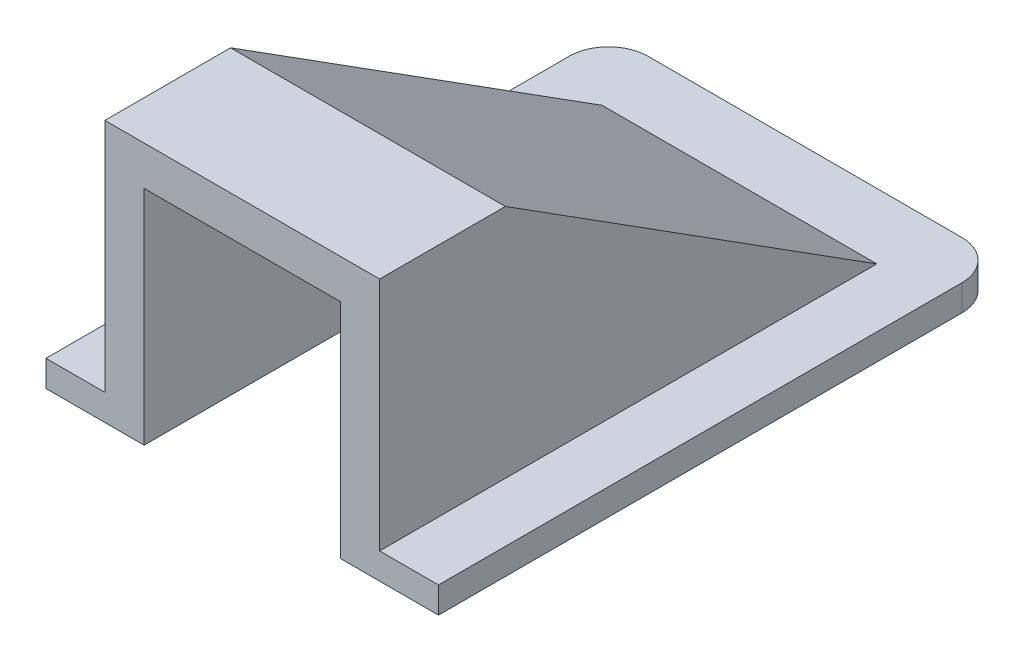
ISO-10303-21;
HEADER;
FILE_DESCRIPTION(('STEP AP214'),'2;1');
FILE_NAME('part.step','',(''),(''),'','','');
FILE_SCHEMA(('AUTOMOTIVE_DESIGN { 1 0 10303 214 1 1 1 1 }'));
ENDSEC;
DATA;
#1=APPLICATION_CONTEXT('core data for automotive mechanical design processes');
#2=APPLICATION_PROTOCOL_DEFINITION('international standard','automotive_design',2000,#1);
#3=PRODUCT_CONTEXT('',#1,'mechanical');
#4=PRODUCT('Part','Part','',(#3));
#5=PRODUCT_RELATED_PRODUCT_CATEGORY('part','',(#4));
#6=PRODUCT_DEFINITION_FORMATION('','',#4);
#7=PRODUCT_DEFINITION_CONTEXT('part definition',#1,'design');
#8=PRODUCT_DEFINITION('design','',#6,#7);
#9=PRODUCT_DEFINITION_SHAPE('','',#8);
#10=(LENGTH_UNIT() NAMED_UNIT(*) SI_UNIT(.MILLI.,.METRE.));
#11=(NAMED_UNIT(*) PLANE_ANGLE_UNIT() SI_UNIT($,.RADIAN.));
#12=(NAMED_UNIT(*) SI_UNIT($,.STERADIAN.) SOLID_ANGLE_UNIT());
#13=UNCERTAINTY_MEASURE_WITH_UNIT(LENGTH_MEASURE(1.E-05),#10,'distance_accuracy_value','');
#14=(GEOMETRIC_REPRESENTATION_CONTEXT(3) GLOBAL_UNCERTAINTY_ASSIGNED_CONTEXT((#13)) GLOBAL_UNIT_ASSIGNED_CONTEXT((#10,
#11,#12)) REPRESENTATION_CONTEXT('',''));
#15=CARTESIAN_POINT('',(0.,0.,0.));
#16=DIRECTION('',(0.,0.,1.));
#17=DIRECTION('',(1.,0.,0.));
#18=AXIS2_PLACEMENT_3D('',#15,#16,#17);
#19=CARTESIAN_POINT('',(30.,1.47718631178707,41.2832699619772));
#20=DIRECTION('',(0.,0.,-1.));
#21=DIRECTION('',(0.,1.,0.));
#22=AXIS2_PLACEMENT_3D('',#19,#20,#21);
#23=PLANE('',#22);
#24=DIRECTION('',(-1.,0.,0.));
#25=VECTOR('',#24,1.);
#26=CARTESIAN_POINT('',(30.,-18.5228136882129,41.2832699619772));
#27=LINE('',#26,#25);
#28=CARTESIAN_POINT('',(30.,-18.5228136882129,41.2832699619772));
#29=VERTEX_POINT('',#28);
#30=CARTESIAN_POINT('',(22.5,-18.5228136882129,41.2832699619772));
#31=VERTEX_POINT('',#30);
#32=EDGE_CURVE('E170',#29,#31,#27,.T.);
#33=ORIENTED_EDGE('',*,*,#32,.F.);
#34=DIRECTION('',(0.,-1.,0.));
#35=VECTOR('',#34,1.);
#36=CARTESIAN_POINT('',(30.,1.47718631178707,41.2832699619772));
#37=LINE('',#36,#35);
#38=CARTESIAN_POINT('',(30.,-16.5228136882129,41.2832699619772));
#39=VERTEX_POINT('',#38);
#40=EDGE_CURVE('E230',#39,#29,#37,.T.);
#41=ORIENTED_EDGE('',*,*,#40,.F.);
#42=DIRECTION('',(1.,0.,0.));
#43=VECTOR('',#42,1.);
#44=CARTESIAN_POINT('',(25.5,-16.5228136882129,41.2832699619772));
#45=LINE('',#44,#43);
#46=CARTESIAN_POINT('',(25.5,-16.5228136882129,41.2832699619772));
#47=VERTEX_POINT('',#46);
#48=EDGE_CURVE('E193',#47,#39,#45,.T.);
#49=ORIENTED_EDGE('',*,*,#48,.F.);
#50=DIRECTION('',(0.,-1.,0.));
#51=VECTOR('',#50,1.);
#52=CARTESIAN_POINT('',(25.5,1.47718631178707,41.2832699619772));
#53=LINE('',#52,#51);
#54=CARTESIAN_POINT('',(25.5,1.47718631178707,41.2832699619772));
#55=VERTEX_POINT('',#54);
#56=EDGE_CURVE('E392',#55,#47,#53,.T.);
#57=ORIENTED_EDGE('',*,*,#56,.F.);
#58=DIRECTION('',(-1.,0.,0.));
#59=VECTOR('',#58,1.);
#60=CARTESIAN_POINT('',(30.,1.47718631178707,41.2832699619772));
#61=LINE('',#60,#59);
#62=CARTESIAN_POINT('',(4.5,1.47718631178707,41.2832699619772));
#63=VERTEX_POINT('',#62);
#64=EDGE_CURVE('E234',#55,#63,#61,.T.);
#65=ORIENTED_EDGE('',*,*,#64,.T.);
#66=DIRECTION('',(0.,1.,0.));
#67=VECTOR('',#66,1.);
#68=CARTESIAN_POINT('',(4.5,-16.5228136882129,41.2832699619772));
#69=LINE('',#68,#67);
#70=CARTESIAN_POINT('',(4.5,-16.5228136882129,41.2832699619772));
#71=VERTEX_POINT('',#70);
#72=EDGE_CURVE('E382',#71,#63,#69,.T.);
#73=ORIENTED_EDGE('',*,*,#72,.F.);
#74=DIRECTION('',(-1.,0.,0.));
#75=VECTOR('',#74,1.);
#76=CARTESIAN_POINT('',(4.5,-16.5228136882129,41.2832699619772));
#77=LINE('',#76,#75);
#78=CARTESIAN_POINT('',(0.,-16.5228136882129,41.2832699619772));
#79=VERTEX_POINT('',#78);
#80=EDGE_CURVE('E389',#71,#79,#77,.T.);
#81=ORIENTED_EDGE('',*,*,#80,.T.);
#82=DIRECTION('',(0.,-1.,0.));
#83=VECTOR('',#82,1.);
#84=CARTESIAN_POINT('',(0.,1.47718631178707,41.2832699619772));
#85=LINE('',#84,#83);
#86=CARTESIAN_POINT('',(0.,-18.5228136882129,41.2832699619772));
#87=VERTEX_POINT('',#86);
#88=EDGE_CURVE('E168',#79,#87,#85,.T.);
#89=ORIENTED_EDGE('',*,*,#88,.T.);
#90=CARTESIAN_POINT('',(7.5,-18.5228136882129,41.2832699619772));
#91=VERTEX_POINT('',#90);
#92=EDGE_CURVE('E150',#91,#87,#27,.T.);
#93=ORIENTED_EDGE('',*,*,#92,.F.);
#94=DIRECTION('',(0.,1.,0.));
#95=VECTOR('',#94,1.);
#96=CARTESIAN_POINT('',(7.5,-16.5228136882129,41.2832699619772));
#97=LINE('',#96,#95);
#98=CARTESIAN_POINT('',(7.5,-1.52281368821293,41.2832699619772));
#99=VERTEX_POINT('',#98);
#100=EDGE_CURVE('E164',#91,#99,#97,.T.);
#101=ORIENTED_EDGE('',*,*,#100,.T.);
#102=DIRECTION('',(1.,0.,0.));
#103=VECTOR('',#102,1.);
#104=CARTESIAN_POINT('',(-35.7012285450742,-1.52281368821293,41.2832699619772));
#105=LINE('',#104,#103);
#106=CARTESIAN_POINT('',(22.5,-1.52281368821293,41.2832699619772));
#107=VERTEX_POINT('',#106);
#108=EDGE_CURVE('E202',#99,#107,#105,.T.);
#109=ORIENTED_EDGE('',*,*,#108,.T.);
#110=DIRECTION('',(0.,-1.,0.));
#111=VECTOR('',#110,1.);
#112=CARTESIAN_POINT('',(22.5,-16.5228136882129,41.2832699619772));
#113=LINE('',#112,#111);
#114=EDGE_CURVE('E188',#107,#31,#113,.T.);
#115=ORIENTED_EDGE('',*,*,#114,.T.);
#116=EDGE_LOOP('',(#33,#41,#49,#57,#65,#73,#81,#89,#93,#101,#109,#115));
#117=FACE_BOUND('',#116,.T.);
#118=ADVANCED_FACE('F40',(#117),#23,.F.);
#119=CARTESIAN_POINT('',(30.,0.,0.));
#120=DIRECTION('',(1.,0.,0.));
#121=DIRECTION('',(0.,0.,-1.));
#122=AXIS2_PLACEMENT_3D('',#119,#120,#121);
#123=PLANE('',#122);
#124=ORIENTED_EDGE('',*,*,#40,.T.);
#125=DIRECTION('',(0.,0.,1.));
#126=VECTOR('',#125,1.);
#127=CARTESIAN_POINT('',(30.,-18.5228136882129,38.2832699619772));
#128=LINE('',#127,#126);
#129=CARTESIAN_POINT('',(30.,-18.5228136882129,1.28326996197718));
#130=VERTEX_POINT('',#129);
#131=EDGE_CURVE('E211',#130,#29,#128,.T.);
#132=ORIENTED_EDGE('',*,*,#131,.F.);
#133=DIRECTION('',(0.,1.,0.));
#134=VECTOR('',#133,1.);
#135=CARTESIAN_POINT('',(30.,-16.5228136882129,1.28326996197718));
#136=LINE('',#135,#134);
#137=CARTESIAN_POINT('',(30.,-16.5228136882129,1.28326996197718));
#138=VERTEX_POINT('',#137);
#139=EDGE_CURVE('E243',#130,#138,#136,.T.);
#140=ORIENTED_EDGE('',*,*,#139,.T.);
#141=DIRECTION('',(0.,0.,-1.));
#142=VECTOR('',#141,1.);
#143=CARTESIAN_POINT('',(30.,-16.5228136882129,3.28326996197718));
#144=LINE('',#143,#142);
#145=EDGE_CURVE('E177',#39,#138,#144,.T.);
#146=ORIENTED_EDGE('',*,*,#145,.F.);
#147=EDGE_LOOP('',(#124,#132,#140,#146));
#148=FACE_BOUND('',#147,.T.);
#149=ADVANCED_FACE('F270',(#148),#123,.T.);
#150=CARTESIAN_POINT('',(0.,0.,0.));
#151=DIRECTION('',(1.,0.,0.));
#152=DIRECTION('',(0.,0.,-1.));
#153=AXIS2_PLACEMENT_3D('',#150,#151,#152);
#154=PLANE('',#153);
#155=DIRECTION('',(0.,0.,1.));
#156=VECTOR('',#155,1.);
#157=CARTESIAN_POINT('',(0.,-18.5228136882129,0.));
#158=LINE('',#157,#156);
#159=CARTESIAN_POINT('',(0.,-18.5228136882129,1.28326996197718));
#160=VERTEX_POINT('',#159);
#161=EDGE_CURVE('E240',#160,#87,#158,.T.);
#162=ORIENTED_EDGE('',*,*,#161,.T.);
#163=ORIENTED_EDGE('',*,*,#88,.F.);
#164=DIRECTION('',(0.,0.,-1.));
#165=VECTOR('',#164,1.);
#166=CARTESIAN_POINT('',(0.,-16.5228136882129,3.28326996197718));
#167=LINE('',#166,#165);
#168=CARTESIAN_POINT('',(0.,-16.5228136882129,1.28326996197718));
#169=VERTEX_POINT('',#168);
#170=EDGE_CURVE('E182',#79,#169,#167,.T.);
#171=ORIENTED_EDGE('',*,*,#170,.T.);
#172=DIRECTION('',(0.,1.,0.));
#173=VECTOR('',#172,1.);
#174=CARTESIAN_POINT('',(0.,0.,1.28326996197719));
#175=LINE('',#174,#173);
#176=EDGE_CURVE('E12',#169,#160,#175,.F.);
#177=ORIENTED_EDGE('',*,*,#176,.T.);
#178=EDGE_LOOP('',(#162,#163,#171,#177));
#179=FACE_BOUND('',#178,.T.);
#180=ADVANCED_FACE('F282',(#179),#154,.F.);
#181=CARTESIAN_POINT('',(22.5,0.,0.));
#182=DIRECTION('',(-1.,0.,0.));
#183=DIRECTION('',(0.,0.,1.));
#184=AXIS2_PLACEMENT_3D('',#181,#182,#183);
#185=PLANE('',#184);
#186=DIRECTION('',(0.,0.,-1.));
#187=VECTOR('',#186,1.);
#188=CARTESIAN_POINT('',(22.5,-18.5228136882129,38.2832699619772));
#189=LINE('',#188,#187);
#190=CARTESIAN_POINT('',(22.5,-18.5228136882129,8.8860830528083));
#191=VERTEX_POINT('',#190);
#192=EDGE_CURVE('E56',#31,#191,#189,.T.);
#193=ORIENTED_EDGE('',*,*,#192,.F.);
#194=ORIENTED_EDGE('',*,*,#114,.F.);
#195=DIRECTION('',(0.,0.,1.));
#196=VECTOR('',#195,1.);
#197=CARTESIAN_POINT('',(22.5,-1.52281368821293,41.2832699619772));
#198=LINE('',#197,#196);
#199=CARTESIAN_POINT('',(22.5,-1.52281368821293,32.5459195541393));
#200=VERTEX_POINT('',#199);
#201=EDGE_CURVE('E197',#200,#107,#198,.T.);
#202=ORIENTED_EDGE('',*,*,#201,.F.);
#203=DIRECTION('',(0.,0.535445311375715,0.844569901503578));
#204=VECTOR('',#203,1.);
#205=CARTESIAN_POINT('',(22.5,-1.52281368821293,32.5459195541393));
#206=LINE('',#205,#204);
#207=CARTESIAN_POINT('',(22.5,-16.5228136882129,8.8860830528083));
#208=VERTEX_POINT('',#207);
#209=EDGE_CURVE('E192',#208,#200,#206,.T.);
#210=ORIENTED_EDGE('',*,*,#209,.F.);
#211=DIRECTION('',(0.,1.,0.));
#212=VECTOR('',#211,1.);
#213=CARTESIAN_POINT('',(22.5,-21.0228136882129,8.8860830528083));
#214=LINE('',#213,#212);
#215=EDGE_CURVE('E159',#191,#208,#214,.T.);
#216=ORIENTED_EDGE('',*,*,#215,.F.);
#217=EDGE_LOOP('',(#193,#194,#202,#210,#216));
#218=FACE_BOUND('',#217,.T.);
#219=ADVANCED_FACE('F284',(#218),#185,.T.);
#220=CARTESIAN_POINT('',(7.5,0.,0.));
#221=DIRECTION('',(1.,0.,0.));
#222=DIRECTION('',(0.,0.,-1.));
#223=AXIS2_PLACEMENT_3D('',#220,#221,#222);
#224=PLANE('',#223);
#225=ORIENTED_EDGE('',*,*,#100,.F.);
#226=DIRECTION('',(0.,0.,1.));
#227=VECTOR('',#226,1.);
#228=CARTESIAN_POINT('',(7.5,-18.5228136882129,38.2832699619772));
#229=LINE('',#228,#227);
#230=CARTESIAN_POINT('',(7.5,-18.5228136882129,8.8860830528083));
#231=VERTEX_POINT('',#230);
#232=EDGE_CURVE('E147',#231,#91,#229,.T.);
#233=ORIENTED_EDGE('',*,*,#232,.F.);
#234=DIRECTION('',(0.,1.,0.));
#235=VECTOR('',#234,1.);
#236=CARTESIAN_POINT('',(7.5,-21.0228136882129,8.8860830528083));
#237=LINE('',#236,#235);
#238=CARTESIAN_POINT('',(7.5,-16.5228136882129,8.8860830528083));
#239=VERTEX_POINT('',#238);
#240=EDGE_CURVE('E370',#231,#239,#237,.T.);
#241=ORIENTED_EDGE('',*,*,#240,.T.);
#242=DIRECTION('',(0.,-0.535445311375715,-0.844569901503578));
#243=VECTOR('',#242,1.);
#244=CARTESIAN_POINT('',(7.5,-1.52281368821293,32.5459195541393));
#245=LINE('',#244,#243);
#246=CARTESIAN_POINT('',(7.5,-1.52281368821293,32.5459195541393));
#247=VERTEX_POINT('',#246);
#248=EDGE_CURVE('E184',#247,#239,#245,.T.);
#249=ORIENTED_EDGE('',*,*,#248,.F.);
#250=DIRECTION('',(0.,0.,-1.));
#251=VECTOR('',#250,1.);
#252=CARTESIAN_POINT('',(7.5,-1.52281368821293,41.2832699619772));
#253=LINE('',#252,#251);
#254=EDGE_CURVE('E175',#99,#247,#253,.T.);
#255=ORIENTED_EDGE('',*,*,#254,.F.);
#256=EDGE_LOOP('',(#225,#233,#241,#249,#255));
#257=FACE_BOUND('',#256,.T.);
#258=ADVANCED_FACE('F173',(#257),#224,.T.);
#259=CARTESIAN_POINT('',(30.,1.47718631178707,41.2832699619772));
#260=DIRECTION('',(0.,-1.,0.));
#261=DIRECTION('',(0.,0.,-1.));
#262=AXIS2_PLACEMENT_3D('',#259,#260,#261);
#263=PLANE('',#262);
#264=DIRECTION('',(0.,0.,-1.));
#265=VECTOR('',#264,1.);
#266=CARTESIAN_POINT('',(4.5,1.47718631178707,41.2832699619772));
#267=LINE('',#266,#265);
#268=CARTESIAN_POINT('',(4.5,1.47718631178707,31.6750737635743));
#269=VERTEX_POINT('',#268);
#270=EDGE_CURVE('E349',#63,#269,#267,.T.);
#271=ORIENTED_EDGE('',*,*,#270,.F.);
#272=ORIENTED_EDGE('',*,*,#64,.F.);
#273=DIRECTION('',(0.,0.,1.));
#274=VECTOR('',#273,1.);
#275=CARTESIAN_POINT('',(25.5,1.47718631178707,31.6750737635743));
#276=LINE('',#275,#274);
#277=CARTESIAN_POINT('',(25.5,1.47718631178707,31.6750737635743));
#278=VERTEX_POINT('',#277);
#279=EDGE_CURVE('E354',#278,#55,#276,.T.);
#280=ORIENTED_EDGE('',*,*,#279,.F.);
#281=DIRECTION('',(1.,0.,0.));
#282=VECTOR('',#281,1.);
#283=CARTESIAN_POINT('',(0.,1.47718631178707,31.6750737635743));
#284=LINE('',#283,#282);
#285=EDGE_CURVE('E217',#269,#278,#284,.T.);
#286=ORIENTED_EDGE('',*,*,#285,.F.);
#287=EDGE_LOOP('',(#271,#272,#280,#286));
#288=FACE_BOUND('',#287,.T.);
#289=ADVANCED_FACE('F319',(#288),#263,.F.);
#290=CARTESIAN_POINT('',(0.,1.47718631178707,31.6750737635743));
#291=DIRECTION('',(0.,-0.844569901503578,0.535445311375715));
#292=DIRECTION('',(0.,-0.535445311375715,-0.844569901503578));
#293=AXIS2_PLACEMENT_3D('',#290,#291,#292);
#294=PLANE('',#293);
#295=DIRECTION('',(0.,-0.535445311375715,-0.844569901503578));
#296=VECTOR('',#295,1.);
#297=CARTESIAN_POINT('',(4.5,1.47718631178707,31.6750737635743));
#298=LINE('',#297,#296);
#299=CARTESIAN_POINT('',(4.5,-16.5228136882129,3.28326996197718));
#300=VERTEX_POINT('',#299);
#301=EDGE_CURVE('E341',#269,#300,#298,.T.);
#302=ORIENTED_EDGE('',*,*,#301,.F.);
#303=ORIENTED_EDGE('',*,*,#285,.T.);
#304=DIRECTION('',(0.,0.535445311375715,0.844569901503578));
#305=VECTOR('',#304,1.);
#306=CARTESIAN_POINT('',(25.5,-16.5228136882129,3.28326996197718));
#307=LINE('',#306,#305);
#308=CARTESIAN_POINT('',(25.5,-16.5228136882129,3.28326996197718));
#309=VERTEX_POINT('',#308);
#310=EDGE_CURVE('E358',#309,#278,#307,.T.);
#311=ORIENTED_EDGE('',*,*,#310,.F.);
#312=DIRECTION('',(1.,0.,0.));
#313=VECTOR('',#312,1.);
#314=CARTESIAN_POINT('',(0.,-16.5228136882129,3.28326996197718));
#315=LINE('',#314,#313);
#316=EDGE_CURVE('E222',#300,#309,#315,.T.);
#317=ORIENTED_EDGE('',*,*,#316,.F.);
#318=EDGE_LOOP('',(#302,#303,#311,#317));
#319=FACE_BOUND('',#318,.T.);
#320=ADVANCED_FACE('F331',(#319),#294,.F.);
#321=CARTESIAN_POINT('',(30.,1.47718631178707,-1.71673003802281));
#322=DIRECTION('',(0.,0.,1.));
#323=DIRECTION('',(0.,-1.,0.));
#324=AXIS2_PLACEMENT_3D('',#321,#322,#323);
#325=PLANE('',#324);
#326=DIRECTION('',(1.,0.,0.));
#327=VECTOR('',#326,1.);
#328=CARTESIAN_POINT('',(0.,-16.5228136882129,-1.71673003802282));
#329=LINE('',#328,#327);
#330=CARTESIAN_POINT('',(3.,-16.5228136882129,-1.71673003802282));
#331=VERTEX_POINT('',#330);
#332=CARTESIAN_POINT('',(27.,-16.5228136882129,-1.71673003802282));
#333=VERTEX_POINT('',#332);
#334=EDGE_CURVE('E215',#331,#333,#329,.T.);
#335=ORIENTED_EDGE('',*,*,#334,.T.);
#336=DIRECTION('',(0.,1.,0.));
#337=VECTOR('',#336,1.);
#338=CARTESIAN_POINT('',(27.,-18.5228136882129,-1.71673003802282));
#339=LINE('',#338,#337);
#340=CARTESIAN_POINT('',(27.,-18.5228136882129,-1.71673003802282));
#341=VERTEX_POINT('',#340);
#342=EDGE_CURVE('E257',#333,#341,#339,.F.);
#343=ORIENTED_EDGE('',*,*,#342,.T.);
#344=DIRECTION('',(-1.,0.,0.));
#345=VECTOR('',#344,1.);
#346=CARTESIAN_POINT('',(30.,-18.5228136882129,-1.71673003802282));
#347=LINE('',#346,#345);
#348=CARTESIAN_POINT('',(3.,-18.5228136882129,-1.71673003802282));
#349=VERTEX_POINT('',#348);
#350=EDGE_CURVE('E214',#341,#349,#347,.T.);
#351=ORIENTED_EDGE('',*,*,#350,.T.);
#352=DIRECTION('',(0.,1.,0.));
#353=VECTOR('',#352,1.);
#354=CARTESIAN_POINT('',(3.,1.47718631178707,-1.71673003802281));
#355=LINE('',#354,#353);
#356=EDGE_CURVE('E253',#349,#331,#355,.T.);
#357=ORIENTED_EDGE('',*,*,#356,.T.);
#358=EDGE_LOOP('',(#335,#343,#351,#357));
#359=FACE_BOUND('',#358,.T.);
#360=ADVANCED_FACE('F278',(#359),#325,.F.);
#361=CARTESIAN_POINT('',(0.,-16.5228136882129,3.28326996197718));
#362=DIRECTION('',(0.,-1.,0.));
#363=DIRECTION('',(0.,0.,-1.));
#364=AXIS2_PLACEMENT_3D('',#361,#362,#363);
#365=PLANE('',#364);
#366=ORIENTED_EDGE('',*,*,#145,.T.);
#367=CARTESIAN_POINT('',(27.,-16.5228136882129,1.28326996197718));
#368=DIRECTION('',(0.,-1.,0.));
#369=DIRECTION('',(0.,0.,-1.));
#370=AXIS2_PLACEMENT_3D('',#367,#368,#369);
#371=CIRCLE('',#370,3.);
#372=EDGE_CURVE('E250',#138,#333,#371,.F.);
#373=ORIENTED_EDGE('',*,*,#372,.T.);
#374=ORIENTED_EDGE('',*,*,#334,.F.);
#375=CARTESIAN_POINT('',(3.,-16.5228136882129,1.28326996197718));
#376=DIRECTION('',(0.,-1.,0.));
#377=DIRECTION('',(0.,0.,-1.));
#378=AXIS2_PLACEMENT_3D('',#375,#376,#377);
#379=CIRCLE('',#378,3.);
#380=EDGE_CURVE('E247',#331,#169,#379,.F.);
#381=ORIENTED_EDGE('',*,*,#380,.T.);
#382=ORIENTED_EDGE('',*,*,#170,.F.);
#383=ORIENTED_EDGE('',*,*,#80,.F.);
#384=DIRECTION('',(0.,0.,1.));
#385=VECTOR('',#384,1.);
#386=CARTESIAN_POINT('',(4.5,-16.5228136882129,3.28326996197718));
#387=LINE('',#386,#385);
#388=EDGE_CURVE('E348',#300,#71,#387,.T.);
#389=ORIENTED_EDGE('',*,*,#388,.F.);
#390=ORIENTED_EDGE('',*,*,#316,.T.);
#391=DIRECTION('',(0.,0.,-1.));
#392=VECTOR('',#391,1.);
#393=CARTESIAN_POINT('',(25.5,-16.5228136882129,3.28326996197718));
#394=LINE('',#393,#392);
#395=EDGE_CURVE('E363',#47,#309,#394,.T.);
#396=ORIENTED_EDGE('',*,*,#395,.F.);
#397=ORIENTED_EDGE('',*,*,#48,.T.);
#398=EDGE_LOOP('',(#366,#373,#374,#381,#382,#383,#389,#390,#396,#397));
#399=FACE_BOUND('',#398,.T.);
#400=ADVANCED_FACE('F275',(#399),#365,.F.);
#401=CARTESIAN_POINT('',(0.,-18.5228136882129,38.2832699619772));
#402=DIRECTION('',(0.,1.,0.));
#403=DIRECTION('',(0.,0.,1.));
#404=AXIS2_PLACEMENT_3D('',#401,#402,#403);
#405=PLANE('',#404);
#406=ORIENTED_EDGE('',*,*,#192,.T.);
#407=DIRECTION('',(-1.,0.,0.));
#408=VECTOR('',#407,1.);
#409=CARTESIAN_POINT('',(0.,-18.5228136882129,8.8860830528083));
#410=LINE('',#409,#408);
#411=EDGE_CURVE('E153',#191,#231,#410,.T.);
#412=ORIENTED_EDGE('',*,*,#411,.T.);
#413=ORIENTED_EDGE('',*,*,#232,.T.);
#414=ORIENTED_EDGE('',*,*,#92,.T.);
#415=ORIENTED_EDGE('',*,*,#161,.F.);
#416=CARTESIAN_POINT('',(3.,-18.5228136882129,1.28326996197718));
#417=DIRECTION('',(0.,1.,0.));
#418=DIRECTION('',(0.,0.,1.));
#419=AXIS2_PLACEMENT_3D('',#416,#417,#418);
#420=CIRCLE('',#419,3.);
#421=EDGE_CURVE('E260',#160,#349,#420,.F.);
#422=ORIENTED_EDGE('',*,*,#421,.T.);
#423=ORIENTED_EDGE('',*,*,#350,.F.);
#424=CARTESIAN_POINT('',(27.,-18.5228136882129,1.28326996197718));
#425=DIRECTION('',(0.,1.,0.));
#426=DIRECTION('',(0.,0.,1.));
#427=AXIS2_PLACEMENT_3D('',#424,#425,#426);
#428=CIRCLE('',#427,3.);
#429=EDGE_CURVE('E49',#341,#130,#428,.F.);
#430=ORIENTED_EDGE('',*,*,#429,.T.);
#431=ORIENTED_EDGE('',*,*,#131,.T.);
#432=ORIENTED_EDGE('',*,*,#32,.T.);
#433=EDGE_LOOP('',(#406,#412,#413,#414,#415,#422,#423,#430,#431,#432));
#434=FACE_BOUND('',#433,.T.);
#435=ADVANCED_FACE('F149',(#434),#405,.F.);
#436=CARTESIAN_POINT('',(-35.7012285450742,-1.52281368821293,41.2832699619772));
#437=DIRECTION('',(0.,1.,0.));
#438=DIRECTION('',(0.,0.,1.));
#439=AXIS2_PLACEMENT_3D('',#436,#437,#438);
#440=PLANE('',#439);
#441=ORIENTED_EDGE('',*,*,#254,.T.);
#442=DIRECTION('',(1.,0.,0.));
#443=VECTOR('',#442,1.);
#444=CARTESIAN_POINT('',(-35.7012285450742,-1.52281368821293,32.5459195541393));
#445=LINE('',#444,#443);
#446=EDGE_CURVE('E205',#247,#200,#445,.T.);
#447=ORIENTED_EDGE('',*,*,#446,.T.);
#448=ORIENTED_EDGE('',*,*,#201,.T.);
#449=ORIENTED_EDGE('',*,*,#108,.F.);
#450=EDGE_LOOP('',(#441,#447,#448,#449));
#451=FACE_BOUND('',#450,.T.);
#452=ADVANCED_FACE('F321',(#451),#440,.F.);
#453=CARTESIAN_POINT('',(-35.7012285450742,-1.52281368821293,32.5459195541393));
#454=DIRECTION('',(0.,0.844569901503578,-0.535445311375715));
#455=DIRECTION('',(0.,0.535445311375715,0.844569901503578));
#456=AXIS2_PLACEMENT_3D('',#453,#454,#455);
#457=PLANE('',#456);
#458=ORIENTED_EDGE('',*,*,#248,.T.);
#459=DIRECTION('',(1.,0.,0.));
#460=VECTOR('',#459,1.);
#461=CARTESIAN_POINT('',(-35.7012285450742,-16.5228136882129,8.8860830528083));
#462=LINE('',#461,#460);
#463=EDGE_CURVE('E201',#239,#208,#462,.T.);
#464=ORIENTED_EDGE('',*,*,#463,.T.);
#465=ORIENTED_EDGE('',*,*,#209,.T.);
#466=ORIENTED_EDGE('',*,*,#446,.F.);
#467=EDGE_LOOP('',(#458,#464,#465,#466));
#468=FACE_BOUND('',#467,.T.);
#469=ADVANCED_FACE('F313',(#468),#457,.F.);
#470=CARTESIAN_POINT('',(25.5,0.,0.));
#471=DIRECTION('',(-1.,0.,0.));
#472=DIRECTION('',(0.,0.,1.));
#473=AXIS2_PLACEMENT_3D('',#470,#471,#472);
#474=PLANE('',#473);
#475=ORIENTED_EDGE('',*,*,#56,.T.);
#476=ORIENTED_EDGE('',*,*,#395,.T.);
#477=ORIENTED_EDGE('',*,*,#310,.T.);
#478=ORIENTED_EDGE('',*,*,#279,.T.);
#479=EDGE_LOOP('',(#475,#476,#477,#478));
#480=FACE_BOUND('',#479,.T.);
#481=ADVANCED_FACE('F306',(#480),#474,.F.);
#482=CARTESIAN_POINT('',(4.5,0.,0.));
#483=DIRECTION('',(-1.,0.,0.));
#484=DIRECTION('',(0.,0.,1.));
#485=AXIS2_PLACEMENT_3D('',#482,#483,#484);
#486=PLANE('',#485);
#487=ORIENTED_EDGE('',*,*,#72,.T.);
#488=ORIENTED_EDGE('',*,*,#270,.T.);
#489=ORIENTED_EDGE('',*,*,#301,.T.);
#490=ORIENTED_EDGE('',*,*,#388,.T.);
#491=EDGE_LOOP('',(#487,#488,#489,#490));
#492=FACE_BOUND('',#491,.T.);
#493=ADVANCED_FACE('F300',(#492),#486,.T.);
#494=CARTESIAN_POINT('',(27.,0.,1.28326996197719));
#495=DIRECTION('',(0.,-1.,0.));
#496=DIRECTION('',(0.,0.,-1.));
#497=AXIS2_PLACEMENT_3D('',#494,#495,#496);
#498=CYLINDRICAL_SURFACE('',#497,3.);
#499=ORIENTED_EDGE('',*,*,#429,.F.);
#500=ORIENTED_EDGE('',*,*,#342,.F.);
#501=ORIENTED_EDGE('',*,*,#372,.F.);
#502=ORIENTED_EDGE('',*,*,#139,.F.);
#503=EDGE_LOOP('',(#499,#500,#501,#502));
#504=FACE_BOUND('',#503,.T.);
#505=ADVANCED_FACE('F272',(#504),#498,.T.);
#506=CARTESIAN_POINT('',(3.,1.47718631178707,1.28326996197719));
#507=DIRECTION('',(0.,1.,0.));
#508=DIRECTION('',(0.,0.,1.));
#509=AXIS2_PLACEMENT_3D('',#506,#507,#508);
#510=CYLINDRICAL_SURFACE('',#509,3.);
#511=ORIENTED_EDGE('',*,*,#421,.F.);
#512=ORIENTED_EDGE('',*,*,#176,.F.);
#513=ORIENTED_EDGE('',*,*,#380,.F.);
#514=ORIENTED_EDGE('',*,*,#356,.F.);
#515=EDGE_LOOP('',(#511,#512,#513,#514));
#516=FACE_BOUND('',#515,.T.);
#517=ADVANCED_FACE('F42',(#516),#510,.T.);
#518=CARTESIAN_POINT('',(22.5,-21.0228136882129,8.8860830528083));
#519=DIRECTION('',(0.,0.,-1.));
#520=DIRECTION('',(0.,1.,0.));
#521=AXIS2_PLACEMENT_3D('',#518,#519,#520);
#522=PLANE('',#521);
#523=ORIENTED_EDGE('',*,*,#215,.T.);
#524=ORIENTED_EDGE('',*,*,#463,.F.);
#525=ORIENTED_EDGE('',*,*,#240,.F.);
#526=ORIENTED_EDGE('',*,*,#411,.F.);
#527=EDGE_LOOP('',(#523,#524,#525,#526));
#528=FACE_BOUND('',#527,.T.);
#529=ADVANCED_FACE('F305',(#528),#522,.F.);
#530=CLOSED_SHELL('',(#118,#149,#180,#219,#258,#289,#320,#360,#400,#435,#452,#469,#481,#493,
#505,#517,#529));
#531=MANIFOLD_SOLID_BREP('B2',#530);
#532=ADVANCED_BREP_SHAPE_REPRESENTATION('',(#18,#531),#14);
#533=SHAPE_DEFINITION_REPRESENTATION(#9,#532);
ENDSEC;
END-ISO-10303-21;
